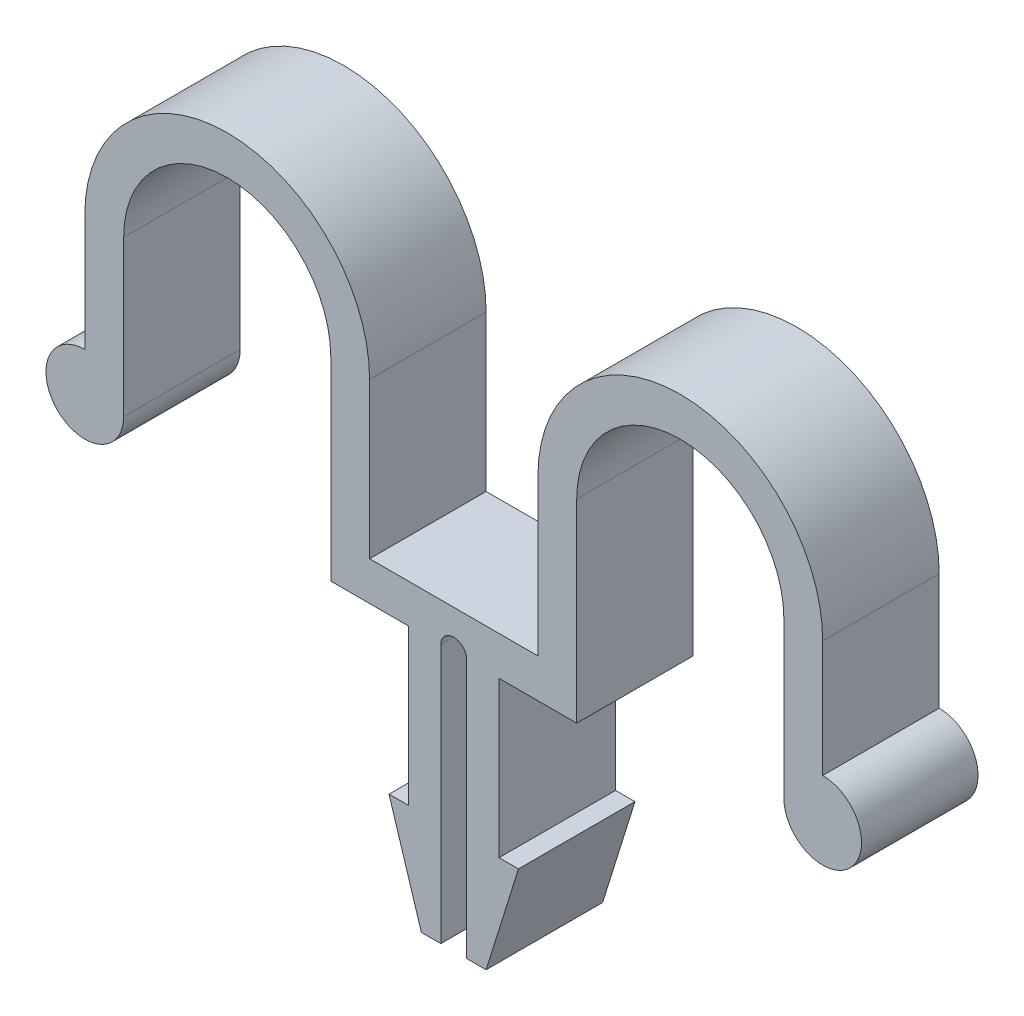
ISO-10303-21;
HEADER;
FILE_DESCRIPTION(('STEP AP214'),'2;1');
FILE_NAME('part.step','',(''),(''),'','','');
FILE_SCHEMA(('AUTOMOTIVE_DESIGN { 1 0 10303 214 1 1 1 1 }'));
ENDSEC;
DATA;
#1=APPLICATION_CONTEXT('core data for automotive mechanical design processes');
#2=APPLICATION_PROTOCOL_DEFINITION('international standard','automotive_design',2000,#1);
#3=PRODUCT_CONTEXT('',#1,'mechanical');
#4=PRODUCT('Part','Part','',(#3));
#5=PRODUCT_RELATED_PRODUCT_CATEGORY('part','',(#4));
#6=PRODUCT_DEFINITION_FORMATION('','',#4);
#7=PRODUCT_DEFINITION_CONTEXT('part definition',#1,'design');
#8=PRODUCT_DEFINITION('design','',#6,#7);
#9=PRODUCT_DEFINITION_SHAPE('','',#8);
#10=(LENGTH_UNIT() NAMED_UNIT(*) SI_UNIT(.MILLI.,.METRE.));
#11=(NAMED_UNIT(*) PLANE_ANGLE_UNIT() SI_UNIT($,.RADIAN.));
#12=(NAMED_UNIT(*) SI_UNIT($,.STERADIAN.) SOLID_ANGLE_UNIT());
#13=UNCERTAINTY_MEASURE_WITH_UNIT(LENGTH_MEASURE(1.E-05),#10,'distance_accuracy_value','');
#14=(GEOMETRIC_REPRESENTATION_CONTEXT(3) GLOBAL_UNCERTAINTY_ASSIGNED_CONTEXT((#13)) GLOBAL_UNIT_ASSIGNED_CONTEXT((#10,
#11,#12)) REPRESENTATION_CONTEXT('',''));
#15=CARTESIAN_POINT('',(0.,0.,0.));
#16=DIRECTION('',(0.,0.,1.));
#17=DIRECTION('',(1.,0.,0.));
#18=AXIS2_PLACEMENT_3D('',#15,#16,#17);
#19=CARTESIAN_POINT('',(0.,0.,9.));
#20=DIRECTION('',(0.,0.,-1.));
#21=DIRECTION('',(-1.,0.,0.));
#22=AXIS2_PLACEMENT_3D('',#19,#20,#21);
#23=CYLINDRICAL_SURFACE('',#22,3.);
#24=CARTESIAN_POINT('',(0.,0.,0.));
#25=DIRECTION('',(0.,0.,1.));
#26=DIRECTION('',(1.,0.,0.));
#27=AXIS2_PLACEMENT_3D('',#24,#25,#26);
#28=CIRCLE('',#27,3.);
#29=CARTESIAN_POINT('',(0.,3.,0.));
#30=VERTEX_POINT('',#29);
#31=CARTESIAN_POINT('',(3.,0.,0.));
#32=VERTEX_POINT('',#31);
#33=EDGE_CURVE('E260',#30,#32,#28,.T.);
#34=ORIENTED_EDGE('',*,*,#33,.T.);
#35=DIRECTION('',(0.,0.,-1.));
#36=VECTOR('',#35,1.);
#37=CARTESIAN_POINT('',(3.,0.,9.));
#38=LINE('',#37,#36);
#39=CARTESIAN_POINT('',(3.,0.,9.));
#40=VERTEX_POINT('',#39);
#41=EDGE_CURVE('E11',#40,#32,#38,.T.);
#42=ORIENTED_EDGE('',*,*,#41,.F.);
#43=CARTESIAN_POINT('',(0.,0.,9.));
#44=DIRECTION('',(0.,0.,1.));
#45=DIRECTION('',(1.,0.,0.));
#46=AXIS2_PLACEMENT_3D('',#43,#44,#45);
#47=CIRCLE('',#46,3.);
#48=CARTESIAN_POINT('',(0.,3.,9.));
#49=VERTEX_POINT('',#48);
#50=EDGE_CURVE('E342',#49,#40,#47,.T.);
#51=ORIENTED_EDGE('',*,*,#50,.F.);
#52=DIRECTION('',(0.,0.,-1.));
#53=VECTOR('',#52,1.);
#54=CARTESIAN_POINT('',(0.,3.,9.));
#55=LINE('',#54,#53);
#56=EDGE_CURVE('E256',#49,#30,#55,.T.);
#57=ORIENTED_EDGE('',*,*,#56,.T.);
#58=EDGE_LOOP('',(#34,#42,#51,#57));
#59=FACE_BOUND('',#58,.T.);
#60=ADVANCED_FACE('F39',(#59),#23,.T.);
#61=CARTESIAN_POINT('',(3.,0.,9.));
#62=DIRECTION('',(-1.,0.,0.));
#63=DIRECTION('',(0.,0.,1.));
#64=AXIS2_PLACEMENT_3D('',#61,#62,#63);
#65=PLANE('',#64);
#66=DIRECTION('',(0.,1.,0.));
#67=VECTOR('',#66,1.);
#68=CARTESIAN_POINT('',(3.,0.,0.));
#69=LINE('',#68,#67);
#70=CARTESIAN_POINT('',(3.,12.,0.));
#71=VERTEX_POINT('',#70);
#72=EDGE_CURVE('E264',#32,#71,#69,.T.);
#73=ORIENTED_EDGE('',*,*,#72,.T.);
#74=DIRECTION('',(0.,0.,-1.));
#75=VECTOR('',#74,1.);
#76=CARTESIAN_POINT('',(3.,12.,9.));
#77=LINE('',#76,#75);
#78=CARTESIAN_POINT('',(3.,12.,9.));
#79=VERTEX_POINT('',#78);
#80=EDGE_CURVE('E48',#79,#71,#77,.T.);
#81=ORIENTED_EDGE('',*,*,#80,.F.);
#82=DIRECTION('',(0.,1.,0.));
#83=VECTOR('',#82,1.);
#84=CARTESIAN_POINT('',(3.,0.,9.));
#85=LINE('',#84,#83);
#86=EDGE_CURVE('E159',#40,#79,#85,.T.);
#87=ORIENTED_EDGE('',*,*,#86,.F.);
#88=ORIENTED_EDGE('',*,*,#41,.T.);
#89=EDGE_LOOP('',(#73,#81,#87,#88));
#90=FACE_BOUND('',#89,.T.);
#91=ADVANCED_FACE('F548',(#90),#65,.F.);
#92=CARTESIAN_POINT('',(11.,12.,9.));
#93=DIRECTION('',(0.,0.,-1.));
#94=DIRECTION('',(-1.,0.,0.));
#95=AXIS2_PLACEMENT_3D('',#92,#93,#94);
#96=CYLINDRICAL_SURFACE('',#95,8.);
#97=CARTESIAN_POINT('',(11.,12.,0.));
#98=DIRECTION('',(0.,0.,-1.));
#99=DIRECTION('',(-1.,0.,0.));
#100=AXIS2_PLACEMENT_3D('',#97,#98,#99);
#101=CIRCLE('',#100,8.);
#102=CARTESIAN_POINT('',(19.,12.,0.));
#103=VERTEX_POINT('',#102);
#104=EDGE_CURVE('E267',#71,#103,#101,.T.);
#105=ORIENTED_EDGE('',*,*,#104,.T.);
#106=DIRECTION('',(0.,0.,-1.));
#107=VECTOR('',#106,1.);
#108=CARTESIAN_POINT('',(19.,12.,9.));
#109=LINE('',#108,#107);
#110=CARTESIAN_POINT('',(19.,12.,9.));
#111=VERTEX_POINT('',#110);
#112=EDGE_CURVE('E433',#111,#103,#109,.T.);
#113=ORIENTED_EDGE('',*,*,#112,.F.);
#114=CARTESIAN_POINT('',(11.,12.,9.));
#115=DIRECTION('',(0.,0.,-1.));
#116=DIRECTION('',(-1.,0.,0.));
#117=AXIS2_PLACEMENT_3D('',#114,#115,#116);
#118=CIRCLE('',#117,8.);
#119=EDGE_CURVE('E443',#79,#111,#118,.T.);
#120=ORIENTED_EDGE('',*,*,#119,.F.);
#121=ORIENTED_EDGE('',*,*,#80,.T.);
#122=EDGE_LOOP('',(#105,#113,#120,#121));
#123=FACE_BOUND('',#122,.T.);
#124=ADVANCED_FACE('F441',(#123),#96,.F.);
#125=CARTESIAN_POINT('',(19.,12.,9.));
#126=DIRECTION('',(1.,0.,0.));
#127=DIRECTION('',(0.,0.,-1.));
#128=AXIS2_PLACEMENT_3D('',#125,#126,#127);
#129=PLANE('',#128);
#130=DIRECTION('',(0.,-1.,0.));
#131=VECTOR('',#130,1.);
#132=CARTESIAN_POINT('',(19.,12.,0.));
#133=LINE('',#132,#131);
#134=CARTESIAN_POINT('',(19.,-3.,0.));
#135=VERTEX_POINT('',#134);
#136=EDGE_CURVE('E270',#103,#135,#133,.T.);
#137=ORIENTED_EDGE('',*,*,#136,.T.);
#138=DIRECTION('',(0.,0.,-1.));
#139=VECTOR('',#138,1.);
#140=CARTESIAN_POINT('',(19.,-3.,9.));
#141=LINE('',#140,#139);
#142=CARTESIAN_POINT('',(19.,-3.,9.));
#143=VERTEX_POINT('',#142);
#144=EDGE_CURVE('E429',#143,#135,#141,.T.);
#145=ORIENTED_EDGE('',*,*,#144,.F.);
#146=DIRECTION('',(0.,-1.,0.));
#147=VECTOR('',#146,1.);
#148=CARTESIAN_POINT('',(19.,12.,9.));
#149=LINE('',#148,#147);
#150=EDGE_CURVE('E462',#111,#143,#149,.T.);
#151=ORIENTED_EDGE('',*,*,#150,.F.);
#152=ORIENTED_EDGE('',*,*,#112,.T.);
#153=EDGE_LOOP('',(#137,#145,#151,#152));
#154=FACE_BOUND('',#153,.T.);
#155=ADVANCED_FACE('F452',(#154),#129,.F.);
#156=CARTESIAN_POINT('',(19.,-3.,9.));
#157=DIRECTION('',(0.,1.,0.));
#158=DIRECTION('',(0.,0.,1.));
#159=AXIS2_PLACEMENT_3D('',#156,#157,#158);
#160=PLANE('',#159);
#161=DIRECTION('',(1.,0.,0.));
#162=VECTOR('',#161,1.);
#163=CARTESIAN_POINT('',(19.,-3.,0.));
#164=LINE('',#163,#162);
#165=CARTESIAN_POINT('',(25.,-3.,0.));
#166=VERTEX_POINT('',#165);
#167=EDGE_CURVE('E273',#135,#166,#164,.T.);
#168=ORIENTED_EDGE('',*,*,#167,.T.);
#169=DIRECTION('',(0.,0.,-1.));
#170=VECTOR('',#169,1.);
#171=CARTESIAN_POINT('',(25.,-3.,9.));
#172=LINE('',#171,#170);
#173=CARTESIAN_POINT('',(25.,-3.,9.));
#174=VERTEX_POINT('',#173);
#175=EDGE_CURVE('E425',#174,#166,#172,.T.);
#176=ORIENTED_EDGE('',*,*,#175,.F.);
#177=DIRECTION('',(1.,0.,0.));
#178=VECTOR('',#177,1.);
#179=CARTESIAN_POINT('',(19.,-3.,9.));
#180=LINE('',#179,#178);
#181=EDGE_CURVE('E458',#143,#174,#180,.T.);
#182=ORIENTED_EDGE('',*,*,#181,.F.);
#183=ORIENTED_EDGE('',*,*,#144,.T.);
#184=EDGE_LOOP('',(#168,#176,#182,#183));
#185=FACE_BOUND('',#184,.T.);
#186=ADVANCED_FACE('F456',(#185),#160,.F.);
#187=CARTESIAN_POINT('',(25.,-3.,9.));
#188=DIRECTION('',(1.,0.,0.));
#189=DIRECTION('',(0.,0.,-1.));
#190=AXIS2_PLACEMENT_3D('',#187,#188,#189);
#191=PLANE('',#190);
#192=DIRECTION('',(0.,-1.,0.));
#193=VECTOR('',#192,1.);
#194=CARTESIAN_POINT('',(25.,-3.,0.));
#195=LINE('',#194,#193);
#196=CARTESIAN_POINT('',(25.,-15.,0.));
#197=VERTEX_POINT('',#196);
#198=EDGE_CURVE('E276',#166,#197,#195,.T.);
#199=ORIENTED_EDGE('',*,*,#198,.T.);
#200=DIRECTION('',(0.,0.,-1.));
#201=VECTOR('',#200,1.);
#202=CARTESIAN_POINT('',(25.,-15.,9.));
#203=LINE('',#202,#201);
#204=CARTESIAN_POINT('',(25.,-15.,9.));
#205=VERTEX_POINT('',#204);
#206=EDGE_CURVE('E421',#205,#197,#203,.T.);
#207=ORIENTED_EDGE('',*,*,#206,.F.);
#208=DIRECTION('',(0.,-1.,0.));
#209=VECTOR('',#208,1.);
#210=CARTESIAN_POINT('',(25.,-3.,9.));
#211=LINE('',#210,#209);
#212=EDGE_CURVE('E461',#174,#205,#211,.T.);
#213=ORIENTED_EDGE('',*,*,#212,.F.);
#214=ORIENTED_EDGE('',*,*,#175,.T.);
#215=EDGE_LOOP('',(#199,#207,#213,#214));
#216=FACE_BOUND('',#215,.T.);
#217=ADVANCED_FACE('F561',(#216),#191,.F.);
#218=CARTESIAN_POINT('',(25.,-15.,9.));
#219=DIRECTION('',(0.,-1.,0.));
#220=DIRECTION('',(0.,0.,-1.));
#221=AXIS2_PLACEMENT_3D('',#218,#219,#220);
#222=PLANE('',#221);
#223=DIRECTION('',(-1.,0.,0.));
#224=VECTOR('',#223,1.);
#225=CARTESIAN_POINT('',(25.,-15.,0.));
#226=LINE('',#225,#224);
#227=CARTESIAN_POINT('',(23.5,-15.,0.));
#228=VERTEX_POINT('',#227);
#229=EDGE_CURVE('E279',#197,#228,#226,.T.);
#230=ORIENTED_EDGE('',*,*,#229,.T.);
#231=DIRECTION('',(0.,0.,-1.));
#232=VECTOR('',#231,1.);
#233=CARTESIAN_POINT('',(23.5,-15.,9.));
#234=LINE('',#233,#232);
#235=CARTESIAN_POINT('',(23.5,-15.,9.));
#236=VERTEX_POINT('',#235);
#237=EDGE_CURVE('E417',#236,#228,#234,.T.);
#238=ORIENTED_EDGE('',*,*,#237,.F.);
#239=DIRECTION('',(-1.,0.,0.));
#240=VECTOR('',#239,1.);
#241=CARTESIAN_POINT('',(25.,-15.,9.));
#242=LINE('',#241,#240);
#243=EDGE_CURVE('E466',#205,#236,#242,.T.);
#244=ORIENTED_EDGE('',*,*,#243,.F.);
#245=ORIENTED_EDGE('',*,*,#206,.T.);
#246=EDGE_LOOP('',(#230,#238,#244,#245));
#247=FACE_BOUND('',#246,.T.);
#248=ADVANCED_FACE('F564',(#247),#222,.F.);
#249=CARTESIAN_POINT('',(23.5,-15.,9.));
#250=DIRECTION('',(0.954479978035029,0.298274993135947,0.));
#251=DIRECTION('',(-0.298274993135947,0.95447997803503,0.));
#252=AXIS2_PLACEMENT_3D('',#249,#250,#251);
#253=PLANE('',#252);
#254=DIRECTION('',(0.298274993135947,-0.95447997803503,0.));
#255=VECTOR('',#254,1.);
#256=CARTESIAN_POINT('',(23.5,-15.,0.));
#257=LINE('',#256,#255);
#258=CARTESIAN_POINT('',(26.,-23.,0.));
#259=VERTEX_POINT('',#258);
#260=EDGE_CURVE('E282',#228,#259,#257,.T.);
#261=ORIENTED_EDGE('',*,*,#260,.T.);
#262=DIRECTION('',(0.,0.,-1.));
#263=VECTOR('',#262,1.);
#264=CARTESIAN_POINT('',(26.,-23.,9.));
#265=LINE('',#264,#263);
#266=CARTESIAN_POINT('',(26.,-23.,9.));
#267=VERTEX_POINT('',#266);
#268=EDGE_CURVE('E413',#267,#259,#265,.T.);
#269=ORIENTED_EDGE('',*,*,#268,.F.);
#270=DIRECTION('',(0.298274993135947,-0.95447997803503,0.));
#271=VECTOR('',#270,1.);
#272=CARTESIAN_POINT('',(23.5,-15.,9.));
#273=LINE('',#272,#271);
#274=EDGE_CURVE('E473',#236,#267,#273,.T.);
#275=ORIENTED_EDGE('',*,*,#274,.F.);
#276=ORIENTED_EDGE('',*,*,#237,.T.);
#277=EDGE_LOOP('',(#261,#269,#275,#276));
#278=FACE_BOUND('',#277,.T.);
#279=ADVANCED_FACE('F568',(#278),#253,.F.);
#280=CARTESIAN_POINT('',(26.,-23.,9.));
#281=DIRECTION('',(0.,1.,0.));
#282=DIRECTION('',(0.,0.,1.));
#283=AXIS2_PLACEMENT_3D('',#280,#281,#282);
#284=PLANE('',#283);
#285=DIRECTION('',(1.,0.,0.));
#286=VECTOR('',#285,1.);
#287=CARTESIAN_POINT('',(26.,-23.,0.));
#288=LINE('',#287,#286);
#289=CARTESIAN_POINT('',(27.5,-23.,0.));
#290=VERTEX_POINT('',#289);
#291=EDGE_CURVE('E285',#259,#290,#288,.T.);
#292=ORIENTED_EDGE('',*,*,#291,.T.);
#293=DIRECTION('',(0.,0.,-1.));
#294=VECTOR('',#293,1.);
#295=CARTESIAN_POINT('',(27.5,-23.,9.));
#296=LINE('',#295,#294);
#297=CARTESIAN_POINT('',(27.5,-23.,9.));
#298=VERTEX_POINT('',#297);
#299=EDGE_CURVE('E409',#298,#290,#296,.T.);
#300=ORIENTED_EDGE('',*,*,#299,.F.);
#301=DIRECTION('',(1.,0.,0.));
#302=VECTOR('',#301,1.);
#303=CARTESIAN_POINT('',(26.,-23.,9.));
#304=LINE('',#303,#302);
#305=EDGE_CURVE('E476',#267,#298,#304,.T.);
#306=ORIENTED_EDGE('',*,*,#305,.F.);
#307=ORIENTED_EDGE('',*,*,#268,.T.);
#308=EDGE_LOOP('',(#292,#300,#306,#307));
#309=FACE_BOUND('',#308,.T.);
#310=ADVANCED_FACE('F572',(#309),#284,.F.);
#311=CARTESIAN_POINT('',(27.5,-23.,9.));
#312=DIRECTION('',(-1.,0.,0.));
#313=DIRECTION('',(0.,0.,1.));
#314=AXIS2_PLACEMENT_3D('',#311,#312,#313);
#315=PLANE('',#314);
#316=DIRECTION('',(0.,1.,0.));
#317=VECTOR('',#316,1.);
#318=CARTESIAN_POINT('',(27.5,-23.,0.));
#319=LINE('',#318,#317);
#320=CARTESIAN_POINT('',(27.5,-3.,0.));
#321=VERTEX_POINT('',#320);
#322=EDGE_CURVE('E288',#290,#321,#319,.T.);
#323=ORIENTED_EDGE('',*,*,#322,.T.);
#324=DIRECTION('',(0.,0.,-1.));
#325=VECTOR('',#324,1.);
#326=CARTESIAN_POINT('',(27.5,-3.,9.));
#327=LINE('',#326,#325);
#328=CARTESIAN_POINT('',(27.5,-3.,9.));
#329=VERTEX_POINT('',#328);
#330=EDGE_CURVE('E405',#329,#321,#327,.T.);
#331=ORIENTED_EDGE('',*,*,#330,.F.);
#332=DIRECTION('',(0.,1.,0.));
#333=VECTOR('',#332,1.);
#334=CARTESIAN_POINT('',(27.5,-23.,9.));
#335=LINE('',#334,#333);
#336=EDGE_CURVE('E479',#298,#329,#335,.T.);
#337=ORIENTED_EDGE('',*,*,#336,.F.);
#338=ORIENTED_EDGE('',*,*,#299,.T.);
#339=EDGE_LOOP('',(#323,#331,#337,#338));
#340=FACE_BOUND('',#339,.T.);
#341=ADVANCED_FACE('F576',(#340),#315,.F.);
#342=CARTESIAN_POINT('',(28.5,-3.,9.));
#343=DIRECTION('',(0.,0.,-1.));
#344=DIRECTION('',(-1.,0.,0.));
#345=AXIS2_PLACEMENT_3D('',#342,#343,#344);
#346=CYLINDRICAL_SURFACE('',#345,1.);
#347=CARTESIAN_POINT('',(28.5,-3.,0.));
#348=DIRECTION('',(0.,0.,-1.));
#349=DIRECTION('',(-1.,0.,0.));
#350=AXIS2_PLACEMENT_3D('',#347,#348,#349);
#351=CIRCLE('',#350,1.);
#352=CARTESIAN_POINT('',(29.5,-3.,0.));
#353=VERTEX_POINT('',#352);
#354=EDGE_CURVE('E291',#321,#353,#351,.T.);
#355=ORIENTED_EDGE('',*,*,#354,.T.);
#356=DIRECTION('',(0.,0.,-1.));
#357=VECTOR('',#356,1.);
#358=CARTESIAN_POINT('',(29.5,-3.,9.));
#359=LINE('',#358,#357);
#360=CARTESIAN_POINT('',(29.5,-3.,9.));
#361=VERTEX_POINT('',#360);
#362=EDGE_CURVE('E401',#361,#353,#359,.T.);
#363=ORIENTED_EDGE('',*,*,#362,.F.);
#364=CARTESIAN_POINT('',(28.5,-3.,9.));
#365=DIRECTION('',(0.,0.,-1.));
#366=DIRECTION('',(-1.,0.,0.));
#367=AXIS2_PLACEMENT_3D('',#364,#365,#366);
#368=CIRCLE('',#367,1.);
#369=EDGE_CURVE('E482',#329,#361,#368,.T.);
#370=ORIENTED_EDGE('',*,*,#369,.F.);
#371=ORIENTED_EDGE('',*,*,#330,.T.);
#372=EDGE_LOOP('',(#355,#363,#370,#371));
#373=FACE_BOUND('',#372,.T.);
#374=ADVANCED_FACE('F580',(#373),#346,.F.);
#375=CARTESIAN_POINT('',(29.5,-23.,9.));
#376=DIRECTION('',(1.,0.,0.));
#377=DIRECTION('',(0.,1.,0.));
#378=AXIS2_PLACEMENT_3D('',#375,#376,#377);
#379=PLANE('',#378);
#380=DIRECTION('',(0.,-1.,0.));
#381=VECTOR('',#380,1.);
#382=CARTESIAN_POINT('',(29.5,-23.,0.));
#383=LINE('',#382,#381);
#384=CARTESIAN_POINT('',(29.5,-23.,0.));
#385=VERTEX_POINT('',#384);
#386=EDGE_CURVE('E294',#353,#385,#383,.T.);
#387=ORIENTED_EDGE('',*,*,#386,.T.);
#388=DIRECTION('',(0.,0.,-1.));
#389=VECTOR('',#388,1.);
#390=CARTESIAN_POINT('',(29.5,-23.,9.));
#391=LINE('',#390,#389);
#392=CARTESIAN_POINT('',(29.5,-23.,9.));
#393=VERTEX_POINT('',#392);
#394=EDGE_CURVE('E397',#393,#385,#391,.T.);
#395=ORIENTED_EDGE('',*,*,#394,.F.);
#396=DIRECTION('',(0.,-1.,0.));
#397=VECTOR('',#396,1.);
#398=CARTESIAN_POINT('',(29.5,-23.,9.));
#399=LINE('',#398,#397);
#400=EDGE_CURVE('E485',#361,#393,#399,.T.);
#401=ORIENTED_EDGE('',*,*,#400,.F.);
#402=ORIENTED_EDGE('',*,*,#362,.T.);
#403=EDGE_LOOP('',(#387,#395,#401,#402));
#404=FACE_BOUND('',#403,.T.);
#405=ADVANCED_FACE('F584',(#404),#379,.F.);
#406=CARTESIAN_POINT('',(31.,-23.,9.));
#407=DIRECTION('',(0.,1.,0.));
#408=DIRECTION('',(0.,0.,1.));
#409=AXIS2_PLACEMENT_3D('',#406,#407,#408);
#410=PLANE('',#409);
#411=DIRECTION('',(1.,0.,0.));
#412=VECTOR('',#411,1.);
#413=CARTESIAN_POINT('',(31.,-23.,0.));
#414=LINE('',#413,#412);
#415=CARTESIAN_POINT('',(31.,-23.,0.));
#416=VERTEX_POINT('',#415);
#417=EDGE_CURVE('E297',#385,#416,#414,.T.);
#418=ORIENTED_EDGE('',*,*,#417,.T.);
#419=DIRECTION('',(0.,0.,-1.));
#420=VECTOR('',#419,1.);
#421=CARTESIAN_POINT('',(31.,-23.,9.));
#422=LINE('',#421,#420);
#423=CARTESIAN_POINT('',(31.,-23.,9.));
#424=VERTEX_POINT('',#423);
#425=EDGE_CURVE('E393',#424,#416,#422,.T.);
#426=ORIENTED_EDGE('',*,*,#425,.F.);
#427=DIRECTION('',(1.,0.,0.));
#428=VECTOR('',#427,1.);
#429=CARTESIAN_POINT('',(31.,-23.,9.));
#430=LINE('',#429,#428);
#431=EDGE_CURVE('E488',#393,#424,#430,.T.);
#432=ORIENTED_EDGE('',*,*,#431,.F.);
#433=ORIENTED_EDGE('',*,*,#394,.T.);
#434=EDGE_LOOP('',(#418,#426,#432,#433));
#435=FACE_BOUND('',#434,.T.);
#436=ADVANCED_FACE('F588',(#435),#410,.F.);
#437=CARTESIAN_POINT('',(33.5,-15.,9.));
#438=DIRECTION('',(-0.954479978035029,0.298274993135947,0.));
#439=DIRECTION('',(-0.298274993135947,-0.95447997803503,0.));
#440=AXIS2_PLACEMENT_3D('',#437,#438,#439);
#441=PLANE('',#440);
#442=DIRECTION('',(0.298274993135947,0.95447997803503,0.));
#443=VECTOR('',#442,1.);
#444=CARTESIAN_POINT('',(33.5,-15.,0.));
#445=LINE('',#444,#443);
#446=CARTESIAN_POINT('',(33.5,-15.,0.));
#447=VERTEX_POINT('',#446);
#448=EDGE_CURVE('E300',#416,#447,#445,.T.);
#449=ORIENTED_EDGE('',*,*,#448,.T.);
#450=DIRECTION('',(0.,0.,-1.));
#451=VECTOR('',#450,1.);
#452=CARTESIAN_POINT('',(33.5,-15.,9.));
#453=LINE('',#452,#451);
#454=CARTESIAN_POINT('',(33.5,-15.,9.));
#455=VERTEX_POINT('',#454);
#456=EDGE_CURVE('E389',#455,#447,#453,.T.);
#457=ORIENTED_EDGE('',*,*,#456,.F.);
#458=DIRECTION('',(0.298274993135947,0.95447997803503,0.));
#459=VECTOR('',#458,1.);
#460=CARTESIAN_POINT('',(33.5,-15.,9.));
#461=LINE('',#460,#459);
#462=EDGE_CURVE('E491',#424,#455,#461,.T.);
#463=ORIENTED_EDGE('',*,*,#462,.F.);
#464=ORIENTED_EDGE('',*,*,#425,.T.);
#465=EDGE_LOOP('',(#449,#457,#463,#464));
#466=FACE_BOUND('',#465,.T.);
#467=ADVANCED_FACE('F592',(#466),#441,.F.);
#468=CARTESIAN_POINT('',(32.,-15.,9.));
#469=DIRECTION('',(0.,-1.,0.));
#470=DIRECTION('',(0.,0.,-1.));
#471=AXIS2_PLACEMENT_3D('',#468,#469,#470);
#472=PLANE('',#471);
#473=DIRECTION('',(-1.,0.,0.));
#474=VECTOR('',#473,1.);
#475=CARTESIAN_POINT('',(32.,-15.,0.));
#476=LINE('',#475,#474);
#477=CARTESIAN_POINT('',(32.,-15.,0.));
#478=VERTEX_POINT('',#477);
#479=EDGE_CURVE('E303',#447,#478,#476,.T.);
#480=ORIENTED_EDGE('',*,*,#479,.T.);
#481=DIRECTION('',(0.,0.,-1.));
#482=VECTOR('',#481,1.);
#483=CARTESIAN_POINT('',(32.,-15.,9.));
#484=LINE('',#483,#482);
#485=CARTESIAN_POINT('',(32.,-15.,9.));
#486=VERTEX_POINT('',#485);
#487=EDGE_CURVE('E385',#486,#478,#484,.T.);
#488=ORIENTED_EDGE('',*,*,#487,.F.);
#489=DIRECTION('',(-1.,0.,0.));
#490=VECTOR('',#489,1.);
#491=CARTESIAN_POINT('',(32.,-15.,9.));
#492=LINE('',#491,#490);
#493=EDGE_CURVE('E494',#455,#486,#492,.T.);
#494=ORIENTED_EDGE('',*,*,#493,.F.);
#495=ORIENTED_EDGE('',*,*,#456,.T.);
#496=EDGE_LOOP('',(#480,#488,#494,#495));
#497=FACE_BOUND('',#496,.T.);
#498=ADVANCED_FACE('F596',(#497),#472,.F.);
#499=CARTESIAN_POINT('',(32.,-3.,9.));
#500=DIRECTION('',(-1.,0.,0.));
#501=DIRECTION('',(0.,-1.,0.));
#502=AXIS2_PLACEMENT_3D('',#499,#500,#501);
#503=PLANE('',#502);
#504=DIRECTION('',(0.,1.,0.));
#505=VECTOR('',#504,1.);
#506=CARTESIAN_POINT('',(32.,-3.,0.));
#507=LINE('',#506,#505);
#508=CARTESIAN_POINT('',(32.,-3.,0.));
#509=VERTEX_POINT('',#508);
#510=EDGE_CURVE('E306',#478,#509,#507,.T.);
#511=ORIENTED_EDGE('',*,*,#510,.T.);
#512=DIRECTION('',(0.,0.,-1.));
#513=VECTOR('',#512,1.);
#514=CARTESIAN_POINT('',(32.,-3.,9.));
#515=LINE('',#514,#513);
#516=CARTESIAN_POINT('',(32.,-3.,9.));
#517=VERTEX_POINT('',#516);
#518=EDGE_CURVE('E381',#517,#509,#515,.T.);
#519=ORIENTED_EDGE('',*,*,#518,.F.);
#520=DIRECTION('',(0.,1.,0.));
#521=VECTOR('',#520,1.);
#522=CARTESIAN_POINT('',(32.,-3.,9.));
#523=LINE('',#522,#521);
#524=EDGE_CURVE('E497',#486,#517,#523,.T.);
#525=ORIENTED_EDGE('',*,*,#524,.F.);
#526=ORIENTED_EDGE('',*,*,#487,.T.);
#527=EDGE_LOOP('',(#511,#519,#525,#526));
#528=FACE_BOUND('',#527,.T.);
#529=ADVANCED_FACE('F600',(#528),#503,.F.);
#530=CARTESIAN_POINT('',(38.,-3.,9.));
#531=DIRECTION('',(0.,1.,0.));
#532=DIRECTION('',(-1.,0.,0.));
#533=AXIS2_PLACEMENT_3D('',#530,#531,#532);
#534=PLANE('',#533);
#535=DIRECTION('',(1.,0.,0.));
#536=VECTOR('',#535,1.);
#537=CARTESIAN_POINT('',(38.,-3.,0.));
#538=LINE('',#537,#536);
#539=CARTESIAN_POINT('',(38.,-3.,0.));
#540=VERTEX_POINT('',#539);
#541=EDGE_CURVE('E309',#509,#540,#538,.T.);
#542=ORIENTED_EDGE('',*,*,#541,.T.);
#543=DIRECTION('',(0.,0.,-1.));
#544=VECTOR('',#543,1.);
#545=CARTESIAN_POINT('',(38.,-3.,9.));
#546=LINE('',#545,#544);
#547=CARTESIAN_POINT('',(38.,-3.,9.));
#548=VERTEX_POINT('',#547);
#549=EDGE_CURVE('E377',#548,#540,#546,.T.);
#550=ORIENTED_EDGE('',*,*,#549,.F.);
#551=DIRECTION('',(1.,0.,0.));
#552=VECTOR('',#551,1.);
#553=CARTESIAN_POINT('',(38.,-3.,9.));
#554=LINE('',#553,#552);
#555=EDGE_CURVE('E500',#517,#548,#554,.T.);
#556=ORIENTED_EDGE('',*,*,#555,.F.);
#557=ORIENTED_EDGE('',*,*,#518,.T.);
#558=EDGE_LOOP('',(#542,#550,#556,#557));
#559=FACE_BOUND('',#558,.T.);
#560=ADVANCED_FACE('F604',(#559),#534,.F.);
#561=CARTESIAN_POINT('',(38.,12.,9.));
#562=DIRECTION('',(-1.,0.,0.));
#563=DIRECTION('',(0.,0.,1.));
#564=AXIS2_PLACEMENT_3D('',#561,#562,#563);
#565=PLANE('',#564);
#566=DIRECTION('',(0.,1.,0.));
#567=VECTOR('',#566,1.);
#568=CARTESIAN_POINT('',(38.,12.,0.));
#569=LINE('',#568,#567);
#570=CARTESIAN_POINT('',(38.,12.,0.));
#571=VERTEX_POINT('',#570);
#572=EDGE_CURVE('E312',#540,#571,#569,.T.);
#573=ORIENTED_EDGE('',*,*,#572,.T.);
#574=DIRECTION('',(0.,0.,-1.));
#575=VECTOR('',#574,1.);
#576=CARTESIAN_POINT('',(38.,12.,9.));
#577=LINE('',#576,#575);
#578=CARTESIAN_POINT('',(38.,12.,9.));
#579=VERTEX_POINT('',#578);
#580=EDGE_CURVE('E373',#579,#571,#577,.T.);
#581=ORIENTED_EDGE('',*,*,#580,.F.);
#582=DIRECTION('',(0.,1.,0.));
#583=VECTOR('',#582,1.);
#584=CARTESIAN_POINT('',(38.,12.,9.));
#585=LINE('',#584,#583);
#586=EDGE_CURVE('E503',#548,#579,#585,.T.);
#587=ORIENTED_EDGE('',*,*,#586,.F.);
#588=ORIENTED_EDGE('',*,*,#549,.T.);
#589=EDGE_LOOP('',(#573,#581,#587,#588));
#590=FACE_BOUND('',#589,.T.);
#591=ADVANCED_FACE('F608',(#590),#565,.F.);
#592=CARTESIAN_POINT('',(46.,12.,9.));
#593=DIRECTION('',(0.,0.,-1.));
#594=DIRECTION('',(-1.,0.,0.));
#595=AXIS2_PLACEMENT_3D('',#592,#593,#594);
#596=CYLINDRICAL_SURFACE('',#595,8.);
#597=CARTESIAN_POINT('',(46.,12.,0.));
#598=DIRECTION('',(0.,0.,-1.));
#599=DIRECTION('',(1.,0.,0.));
#600=AXIS2_PLACEMENT_3D('',#597,#598,#599);
#601=CIRCLE('',#600,8.);
#602=CARTESIAN_POINT('',(54.,12.,0.));
#603=VERTEX_POINT('',#602);
#604=EDGE_CURVE('E315',#571,#603,#601,.T.);
#605=ORIENTED_EDGE('',*,*,#604,.T.);
#606=DIRECTION('',(0.,0.,-1.));
#607=VECTOR('',#606,1.);
#608=CARTESIAN_POINT('',(54.,12.,9.));
#609=LINE('',#608,#607);
#610=CARTESIAN_POINT('',(54.,12.,9.));
#611=VERTEX_POINT('',#610);
#612=EDGE_CURVE('E369',#611,#603,#609,.T.);
#613=ORIENTED_EDGE('',*,*,#612,.F.);
#614=CARTESIAN_POINT('',(46.,12.,9.));
#615=DIRECTION('',(0.,0.,-1.));
#616=DIRECTION('',(1.,0.,0.));
#617=AXIS2_PLACEMENT_3D('',#614,#615,#616);
#618=CIRCLE('',#617,8.);
#619=EDGE_CURVE('E506',#579,#611,#618,.T.);
#620=ORIENTED_EDGE('',*,*,#619,.F.);
#621=ORIENTED_EDGE('',*,*,#580,.T.);
#622=EDGE_LOOP('',(#605,#613,#620,#621));
#623=FACE_BOUND('',#622,.T.);
#624=ADVANCED_FACE('F612',(#623),#596,.F.);
#625=CARTESIAN_POINT('',(54.,0.,9.));
#626=DIRECTION('',(1.,0.,0.));
#627=DIRECTION('',(0.,0.,-1.));
#628=AXIS2_PLACEMENT_3D('',#625,#626,#627);
#629=PLANE('',#628);
#630=DIRECTION('',(0.,-1.,0.));
#631=VECTOR('',#630,1.);
#632=CARTESIAN_POINT('',(54.,0.,0.));
#633=LINE('',#632,#631);
#634=CARTESIAN_POINT('',(54.,0.,0.));
#635=VERTEX_POINT('',#634);
#636=EDGE_CURVE('E318',#603,#635,#633,.T.);
#637=ORIENTED_EDGE('',*,*,#636,.T.);
#638=DIRECTION('',(0.,0.,-1.));
#639=VECTOR('',#638,1.);
#640=CARTESIAN_POINT('',(54.,0.,9.));
#641=LINE('',#640,#639);
#642=CARTESIAN_POINT('',(54.,0.,9.));
#643=VERTEX_POINT('',#642);
#644=EDGE_CURVE('E365',#643,#635,#641,.T.);
#645=ORIENTED_EDGE('',*,*,#644,.F.);
#646=DIRECTION('',(0.,-1.,0.));
#647=VECTOR('',#646,1.);
#648=CARTESIAN_POINT('',(54.,0.,9.));
#649=LINE('',#648,#647);
#650=EDGE_CURVE('E509',#611,#643,#649,.T.);
#651=ORIENTED_EDGE('',*,*,#650,.F.);
#652=ORIENTED_EDGE('',*,*,#612,.T.);
#653=EDGE_LOOP('',(#637,#645,#651,#652));
#654=FACE_BOUND('',#653,.T.);
#655=ADVANCED_FACE('F616',(#654),#629,.F.);
#656=CARTESIAN_POINT('',(57.,0.,9.));
#657=DIRECTION('',(0.,0.,-1.));
#658=DIRECTION('',(-1.,0.,0.));
#659=AXIS2_PLACEMENT_3D('',#656,#657,#658);
#660=CYLINDRICAL_SURFACE('',#659,3.);
#661=CARTESIAN_POINT('',(57.,0.,0.));
#662=DIRECTION('',(0.,0.,1.));
#663=DIRECTION('',(-1.,0.,0.));
#664=AXIS2_PLACEMENT_3D('',#661,#662,#663);
#665=CIRCLE('',#664,3.);
#666=CARTESIAN_POINT('',(57.,3.00000000000001,0.));
#667=VERTEX_POINT('',#666);
#668=EDGE_CURVE('E321',#635,#667,#665,.T.);
#669=ORIENTED_EDGE('',*,*,#668,.T.);
#670=DIRECTION('',(0.,0.,-1.));
#671=VECTOR('',#670,1.);
#672=CARTESIAN_POINT('',(57.,3.00000000000001,9.));
#673=LINE('',#672,#671);
#674=CARTESIAN_POINT('',(57.,3.00000000000001,9.));
#675=VERTEX_POINT('',#674);
#676=EDGE_CURVE('E361',#675,#667,#673,.T.);
#677=ORIENTED_EDGE('',*,*,#676,.F.);
#678=CARTESIAN_POINT('',(57.,0.,9.));
#679=DIRECTION('',(0.,0.,1.));
#680=DIRECTION('',(-1.,0.,0.));
#681=AXIS2_PLACEMENT_3D('',#678,#679,#680);
#682=CIRCLE('',#681,3.);
#683=EDGE_CURVE('E512',#643,#675,#682,.T.);
#684=ORIENTED_EDGE('',*,*,#683,.F.);
#685=ORIENTED_EDGE('',*,*,#644,.T.);
#686=EDGE_LOOP('',(#669,#677,#684,#685));
#687=FACE_BOUND('',#686,.T.);
#688=ADVANCED_FACE('F620',(#687),#660,.T.);
#689=CARTESIAN_POINT('',(57.,3.00000000000001,9.));
#690=DIRECTION('',(-1.,0.,0.));
#691=DIRECTION('',(0.,0.,1.));
#692=AXIS2_PLACEMENT_3D('',#689,#690,#691);
#693=PLANE('',#692);
#694=DIRECTION('',(0.,1.,0.));
#695=VECTOR('',#694,1.);
#696=CARTESIAN_POINT('',(57.,3.00000000000001,0.));
#697=LINE('',#696,#695);
#698=CARTESIAN_POINT('',(57.,12.,0.));
#699=VERTEX_POINT('',#698);
#700=EDGE_CURVE('E324',#667,#699,#697,.T.);
#701=ORIENTED_EDGE('',*,*,#700,.T.);
#702=DIRECTION('',(0.,0.,-1.));
#703=VECTOR('',#702,1.);
#704=CARTESIAN_POINT('',(57.,12.,9.));
#705=LINE('',#704,#703);
#706=CARTESIAN_POINT('',(57.,12.,9.));
#707=VERTEX_POINT('',#706);
#708=EDGE_CURVE('E357',#707,#699,#705,.T.);
#709=ORIENTED_EDGE('',*,*,#708,.F.);
#710=DIRECTION('',(0.,1.,0.));
#711=VECTOR('',#710,1.);
#712=CARTESIAN_POINT('',(57.,3.00000000000001,9.));
#713=LINE('',#712,#711);
#714=EDGE_CURVE('E515',#675,#707,#713,.T.);
#715=ORIENTED_EDGE('',*,*,#714,.F.);
#716=ORIENTED_EDGE('',*,*,#676,.T.);
#717=EDGE_LOOP('',(#701,#709,#715,#716));
#718=FACE_BOUND('',#717,.T.);
#719=ADVANCED_FACE('F624',(#718),#693,.F.);
#720=CARTESIAN_POINT('',(46.,12.,9.));
#721=DIRECTION('',(0.,0.,-1.));
#722=DIRECTION('',(-1.,0.,0.));
#723=AXIS2_PLACEMENT_3D('',#720,#721,#722);
#724=CYLINDRICAL_SURFACE('',#723,11.);
#725=CARTESIAN_POINT('',(46.,12.,0.));
#726=DIRECTION('',(0.,0.,1.));
#727=DIRECTION('',(1.,0.,0.));
#728=AXIS2_PLACEMENT_3D('',#725,#726,#727);
#729=CIRCLE('',#728,11.);
#730=CARTESIAN_POINT('',(35.,12.,0.));
#731=VERTEX_POINT('',#730);
#732=EDGE_CURVE('E327',#699,#731,#729,.T.);
#733=ORIENTED_EDGE('',*,*,#732,.T.);
#734=DIRECTION('',(0.,0.,-1.));
#735=VECTOR('',#734,1.);
#736=CARTESIAN_POINT('',(35.,12.,9.));
#737=LINE('',#736,#735);
#738=CARTESIAN_POINT('',(35.,12.,9.));
#739=VERTEX_POINT('',#738);
#740=EDGE_CURVE('E353',#739,#731,#737,.T.);
#741=ORIENTED_EDGE('',*,*,#740,.F.);
#742=CARTESIAN_POINT('',(46.,12.,9.));
#743=DIRECTION('',(0.,0.,1.));
#744=DIRECTION('',(1.,0.,0.));
#745=AXIS2_PLACEMENT_3D('',#742,#743,#744);
#746=CIRCLE('',#745,11.);
#747=EDGE_CURVE('E518',#707,#739,#746,.T.);
#748=ORIENTED_EDGE('',*,*,#747,.F.);
#749=ORIENTED_EDGE('',*,*,#708,.T.);
#750=EDGE_LOOP('',(#733,#741,#748,#749));
#751=FACE_BOUND('',#750,.T.);
#752=ADVANCED_FACE('F628',(#751),#724,.T.);
#753=CARTESIAN_POINT('',(35.,12.,9.));
#754=DIRECTION('',(1.,0.,0.));
#755=DIRECTION('',(0.,0.,-1.));
#756=AXIS2_PLACEMENT_3D('',#753,#754,#755);
#757=PLANE('',#756);
#758=DIRECTION('',(0.,-1.,0.));
#759=VECTOR('',#758,1.);
#760=CARTESIAN_POINT('',(35.,12.,0.));
#761=LINE('',#760,#759);
#762=CARTESIAN_POINT('',(35.,0.,0.));
#763=VERTEX_POINT('',#762);
#764=EDGE_CURVE('E330',#731,#763,#761,.T.);
#765=ORIENTED_EDGE('',*,*,#764,.T.);
#766=DIRECTION('',(0.,0.,-1.));
#767=VECTOR('',#766,1.);
#768=CARTESIAN_POINT('',(35.,0.,9.));
#769=LINE('',#768,#767);
#770=CARTESIAN_POINT('',(35.,0.,9.));
#771=VERTEX_POINT('',#770);
#772=EDGE_CURVE('E349',#771,#763,#769,.T.);
#773=ORIENTED_EDGE('',*,*,#772,.F.);
#774=DIRECTION('',(0.,-1.,0.));
#775=VECTOR('',#774,1.);
#776=CARTESIAN_POINT('',(35.,12.,9.));
#777=LINE('',#776,#775);
#778=EDGE_CURVE('E521',#739,#771,#777,.T.);
#779=ORIENTED_EDGE('',*,*,#778,.F.);
#780=ORIENTED_EDGE('',*,*,#740,.T.);
#781=EDGE_LOOP('',(#765,#773,#779,#780));
#782=FACE_BOUND('',#781,.T.);
#783=ADVANCED_FACE('F529',(#782),#757,.F.);
#784=CARTESIAN_POINT('',(22.,0.,9.));
#785=DIRECTION('',(0.,-1.,0.));
#786=DIRECTION('',(1.,0.,0.));
#787=AXIS2_PLACEMENT_3D('',#784,#785,#786);
#788=PLANE('',#787);
#789=DIRECTION('',(-1.,0.,0.));
#790=VECTOR('',#789,1.);
#791=CARTESIAN_POINT('',(22.,0.,0.));
#792=LINE('',#791,#790);
#793=CARTESIAN_POINT('',(22.,0.,0.));
#794=VERTEX_POINT('',#793);
#795=EDGE_CURVE('E333',#763,#794,#792,.T.);
#796=ORIENTED_EDGE('',*,*,#795,.T.);
#797=DIRECTION('',(0.,0.,-1.));
#798=VECTOR('',#797,1.);
#799=CARTESIAN_POINT('',(22.,0.,9.));
#800=LINE('',#799,#798);
#801=CARTESIAN_POINT('',(22.,0.,9.));
#802=VERTEX_POINT('',#801);
#803=EDGE_CURVE('E249',#802,#794,#800,.T.);
#804=ORIENTED_EDGE('',*,*,#803,.F.);
#805=DIRECTION('',(-1.,0.,0.));
#806=VECTOR('',#805,1.);
#807=CARTESIAN_POINT('',(22.,0.,9.));
#808=LINE('',#807,#806);
#809=EDGE_CURVE('E238',#771,#802,#808,.T.);
#810=ORIENTED_EDGE('',*,*,#809,.F.);
#811=ORIENTED_EDGE('',*,*,#772,.T.);
#812=EDGE_LOOP('',(#796,#804,#810,#811));
#813=FACE_BOUND('',#812,.T.);
#814=ADVANCED_FACE('F533',(#813),#788,.F.);
#815=CARTESIAN_POINT('',(22.,12.,9.));
#816=DIRECTION('',(-1.,0.,0.));
#817=DIRECTION('',(0.,0.,1.));
#818=AXIS2_PLACEMENT_3D('',#815,#816,#817);
#819=PLANE('',#818);
#820=DIRECTION('',(0.,1.,0.));
#821=VECTOR('',#820,1.);
#822=CARTESIAN_POINT('',(22.,12.,0.));
#823=LINE('',#822,#821);
#824=CARTESIAN_POINT('',(22.,12.,0.));
#825=VERTEX_POINT('',#824);
#826=EDGE_CURVE('E247',#794,#825,#823,.T.);
#827=ORIENTED_EDGE('',*,*,#826,.T.);
#828=DIRECTION('',(0.,0.,-1.));
#829=VECTOR('',#828,1.);
#830=CARTESIAN_POINT('',(22.,12.,9.));
#831=LINE('',#830,#829);
#832=CARTESIAN_POINT('',(22.,12.,9.));
#833=VERTEX_POINT('',#832);
#834=EDGE_CURVE('E244',#833,#825,#831,.T.);
#835=ORIENTED_EDGE('',*,*,#834,.F.);
#836=DIRECTION('',(0.,1.,0.));
#837=VECTOR('',#836,1.);
#838=CARTESIAN_POINT('',(22.,12.,9.));
#839=LINE('',#838,#837);
#840=EDGE_CURVE('E232',#802,#833,#839,.T.);
#841=ORIENTED_EDGE('',*,*,#840,.F.);
#842=ORIENTED_EDGE('',*,*,#803,.T.);
#843=EDGE_LOOP('',(#827,#835,#841,#842));
#844=FACE_BOUND('',#843,.T.);
#845=ADVANCED_FACE('F245',(#844),#819,.F.);
#846=CARTESIAN_POINT('',(11.,12.,9.));
#847=DIRECTION('',(0.,0.,-1.));
#848=DIRECTION('',(-1.,0.,0.));
#849=AXIS2_PLACEMENT_3D('',#846,#847,#848);
#850=CYLINDRICAL_SURFACE('',#849,11.);
#851=CARTESIAN_POINT('',(11.,12.,0.));
#852=DIRECTION('',(0.,0.,1.));
#853=DIRECTION('',(-1.,0.,0.));
#854=AXIS2_PLACEMENT_3D('',#851,#852,#853);
#855=CIRCLE('',#854,11.);
#856=CARTESIAN_POINT('',(0.,12.,0.));
#857=VERTEX_POINT('',#856);
#858=EDGE_CURVE('E145',#825,#857,#855,.T.);
#859=ORIENTED_EDGE('',*,*,#858,.T.);
#860=DIRECTION('',(0.,0.,-1.));
#861=VECTOR('',#860,1.);
#862=CARTESIAN_POINT('',(0.,12.,9.));
#863=LINE('',#862,#861);
#864=CARTESIAN_POINT('',(0.,12.,9.));
#865=VERTEX_POINT('',#864);
#866=EDGE_CURVE('E250',#865,#857,#863,.T.);
#867=ORIENTED_EDGE('',*,*,#866,.F.);
#868=CARTESIAN_POINT('',(11.,12.,9.));
#869=DIRECTION('',(0.,0.,1.));
#870=DIRECTION('',(-1.,0.,0.));
#871=AXIS2_PLACEMENT_3D('',#868,#869,#870);
#872=CIRCLE('',#871,11.);
#873=EDGE_CURVE('E236',#833,#865,#872,.T.);
#874=ORIENTED_EDGE('',*,*,#873,.F.);
#875=ORIENTED_EDGE('',*,*,#834,.T.);
#876=EDGE_LOOP('',(#859,#867,#874,#875));
#877=FACE_BOUND('',#876,.T.);
#878=ADVANCED_FACE('F252',(#877),#850,.T.);
#879=CARTESIAN_POINT('',(0.,3.,9.));
#880=DIRECTION('',(1.,0.,0.));
#881=DIRECTION('',(0.,0.,-1.));
#882=AXIS2_PLACEMENT_3D('',#879,#880,#881);
#883=PLANE('',#882);
#884=DIRECTION('',(0.,-1.,0.));
#885=VECTOR('',#884,1.);
#886=CARTESIAN_POINT('',(0.,3.,0.));
#887=LINE('',#886,#885);
#888=EDGE_CURVE('E151',#857,#30,#887,.T.);
#889=ORIENTED_EDGE('',*,*,#888,.T.);
#890=ORIENTED_EDGE('',*,*,#56,.F.);
#891=DIRECTION('',(0.,-1.,0.));
#892=VECTOR('',#891,1.);
#893=CARTESIAN_POINT('',(0.,3.,9.));
#894=LINE('',#893,#892);
#895=EDGE_CURVE('E56',#865,#49,#894,.T.);
#896=ORIENTED_EDGE('',*,*,#895,.F.);
#897=ORIENTED_EDGE('',*,*,#866,.T.);
#898=EDGE_LOOP('',(#889,#890,#896,#897));
#899=FACE_BOUND('',#898,.T.);
#900=ADVANCED_FACE('F537',(#899),#883,.F.);
#901=CARTESIAN_POINT('',(0.,0.,9.));
#902=DIRECTION('',(0.,0.,1.));
#903=DIRECTION('',(1.,0.,0.));
#904=AXIS2_PLACEMENT_3D('',#901,#902,#903);
#905=PLANE('',#904);
#906=ORIENTED_EDGE('',*,*,#50,.T.);
#907=ORIENTED_EDGE('',*,*,#86,.T.);
#908=ORIENTED_EDGE('',*,*,#119,.T.);
#909=ORIENTED_EDGE('',*,*,#150,.T.);
#910=ORIENTED_EDGE('',*,*,#181,.T.);
#911=ORIENTED_EDGE('',*,*,#212,.T.);
#912=ORIENTED_EDGE('',*,*,#243,.T.);
#913=ORIENTED_EDGE('',*,*,#274,.T.);
#914=ORIENTED_EDGE('',*,*,#305,.T.);
#915=ORIENTED_EDGE('',*,*,#336,.T.);
#916=ORIENTED_EDGE('',*,*,#369,.T.);
#917=ORIENTED_EDGE('',*,*,#400,.T.);
#918=ORIENTED_EDGE('',*,*,#431,.T.);
#919=ORIENTED_EDGE('',*,*,#462,.T.);
#920=ORIENTED_EDGE('',*,*,#493,.T.);
#921=ORIENTED_EDGE('',*,*,#524,.T.);
#922=ORIENTED_EDGE('',*,*,#555,.T.);
#923=ORIENTED_EDGE('',*,*,#586,.T.);
#924=ORIENTED_EDGE('',*,*,#619,.T.);
#925=ORIENTED_EDGE('',*,*,#650,.T.);
#926=ORIENTED_EDGE('',*,*,#683,.T.);
#927=ORIENTED_EDGE('',*,*,#714,.T.);
#928=ORIENTED_EDGE('',*,*,#747,.T.);
#929=ORIENTED_EDGE('',*,*,#778,.T.);
#930=ORIENTED_EDGE('',*,*,#809,.T.);
#931=ORIENTED_EDGE('',*,*,#840,.T.);
#932=ORIENTED_EDGE('',*,*,#873,.T.);
#933=ORIENTED_EDGE('',*,*,#895,.T.);
#934=EDGE_LOOP('',(#906,#907,#908,#909,#910,#911,#912,#913,#914,#915,#916,#917,#918,#919,#920,
#921,#922,#923,#924,#925,#926,#927,#928,#929,#930,#931,#932,#933));
#935=FACE_BOUND('',#934,.T.);
#936=ADVANCED_FACE('F234',(#935),#905,.T.);
#937=CARTESIAN_POINT('',(0.,0.,0.));
#938=DIRECTION('',(0.,0.,1.));
#939=DIRECTION('',(1.,0.,0.));
#940=AXIS2_PLACEMENT_3D('',#937,#938,#939);
#941=PLANE('',#940);
#942=ORIENTED_EDGE('',*,*,#33,.F.);
#943=ORIENTED_EDGE('',*,*,#888,.F.);
#944=ORIENTED_EDGE('',*,*,#858,.F.);
#945=ORIENTED_EDGE('',*,*,#826,.F.);
#946=ORIENTED_EDGE('',*,*,#795,.F.);
#947=ORIENTED_EDGE('',*,*,#764,.F.);
#948=ORIENTED_EDGE('',*,*,#732,.F.);
#949=ORIENTED_EDGE('',*,*,#700,.F.);
#950=ORIENTED_EDGE('',*,*,#668,.F.);
#951=ORIENTED_EDGE('',*,*,#636,.F.);
#952=ORIENTED_EDGE('',*,*,#604,.F.);
#953=ORIENTED_EDGE('',*,*,#572,.F.);
#954=ORIENTED_EDGE('',*,*,#541,.F.);
#955=ORIENTED_EDGE('',*,*,#510,.F.);
#956=ORIENTED_EDGE('',*,*,#479,.F.);
#957=ORIENTED_EDGE('',*,*,#448,.F.);
#958=ORIENTED_EDGE('',*,*,#417,.F.);
#959=ORIENTED_EDGE('',*,*,#386,.F.);
#960=ORIENTED_EDGE('',*,*,#354,.F.);
#961=ORIENTED_EDGE('',*,*,#322,.F.);
#962=ORIENTED_EDGE('',*,*,#291,.F.);
#963=ORIENTED_EDGE('',*,*,#260,.F.);
#964=ORIENTED_EDGE('',*,*,#229,.F.);
#965=ORIENTED_EDGE('',*,*,#198,.F.);
#966=ORIENTED_EDGE('',*,*,#167,.F.);
#967=ORIENTED_EDGE('',*,*,#136,.F.);
#968=ORIENTED_EDGE('',*,*,#104,.F.);
#969=ORIENTED_EDGE('',*,*,#72,.F.);
#970=EDGE_LOOP('',(#942,#943,#944,#945,#946,#947,#948,#949,#950,#951,#952,#953,#954,#955,#956,
#957,#958,#959,#960,#961,#962,#963,#964,#965,#966,#967,#968,#969));
#971=FACE_BOUND('',#970,.T.);
#972=ADVANCED_FACE('F447',(#971),#941,.F.);
#973=CLOSED_SHELL('',(#60,#91,#124,#155,#186,#217,#248,#279,#310,#341,#374,#405,#436,#467,#498,
#529,#560,#591,#624,#655,#688,#719,#752,#783,#814,#845,#878,#900,#936,#972));
#974=MANIFOLD_SOLID_BREP('B2',#973);
#975=ADVANCED_BREP_SHAPE_REPRESENTATION('',(#18,#974),#14);
#976=SHAPE_DEFINITION_REPRESENTATION(#9,#975);
ENDSEC;
END-ISO-10303-21;
